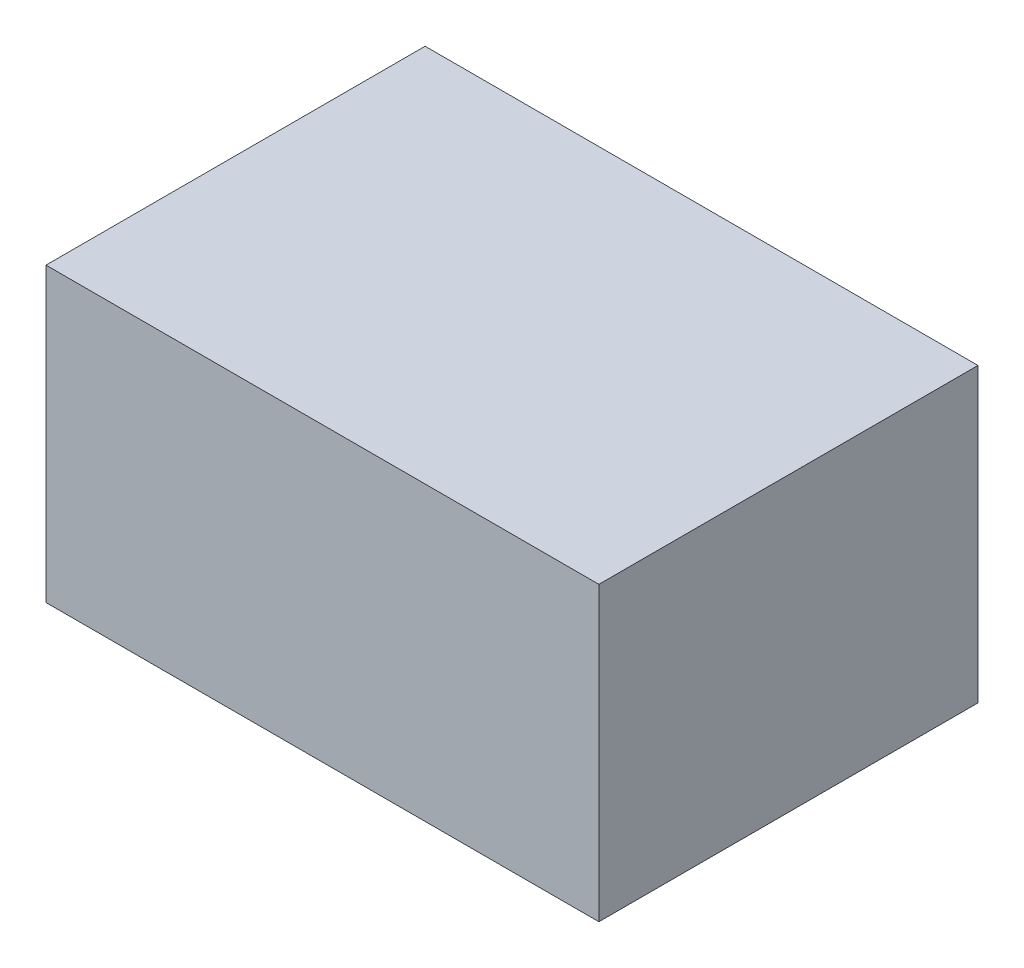
ISO-10303-21;
HEADER;
FILE_DESCRIPTION(('STEP AP214'),'2;1');
FILE_NAME('part.step','',(''),(''),'','','');
FILE_SCHEMA(('AUTOMOTIVE_DESIGN { 1 0 10303 214 1 1 1 1 }'));
ENDSEC;
DATA;
#1=APPLICATION_CONTEXT('core data for automotive mechanical design processes');
#2=APPLICATION_PROTOCOL_DEFINITION('international standard','automotive_design',2000,#1);
#3=PRODUCT_CONTEXT('',#1,'mechanical');
#4=PRODUCT('Part','Part','',(#3));
#5=PRODUCT_RELATED_PRODUCT_CATEGORY('part','',(#4));
#6=PRODUCT_DEFINITION_FORMATION('','',#4);
#7=PRODUCT_DEFINITION_CONTEXT('part definition',#1,'design');
#8=PRODUCT_DEFINITION('design','',#6,#7);
#9=PRODUCT_DEFINITION_SHAPE('','',#8);
#10=(LENGTH_UNIT() NAMED_UNIT(*) SI_UNIT(.MILLI.,.METRE.));
#11=(NAMED_UNIT(*) PLANE_ANGLE_UNIT() SI_UNIT($,.RADIAN.));
#12=(NAMED_UNIT(*) SI_UNIT($,.STERADIAN.) SOLID_ANGLE_UNIT());
#13=UNCERTAINTY_MEASURE_WITH_UNIT(LENGTH_MEASURE(1.E-05),#10,'distance_accuracy_value','');
#14=(GEOMETRIC_REPRESENTATION_CONTEXT(3) GLOBAL_UNCERTAINTY_ASSIGNED_CONTEXT((#13)) GLOBAL_UNIT_ASSIGNED_CONTEXT((#10,
#11,#12)) REPRESENTATION_CONTEXT('',''));
#15=CARTESIAN_POINT('',(0.,0.,0.));
#16=DIRECTION('',(0.,0.,1.));
#17=DIRECTION('',(1.,0.,0.));
#18=AXIS2_PLACEMENT_3D('',#15,#16,#17);
#19=CARTESIAN_POINT('',(11.7151941655056,23.0461624549828,24.));
#20=DIRECTION('',(0.,-1.,0.));
#21=DIRECTION('',(0.,0.,-1.));
#22=AXIS2_PLACEMENT_3D('',#19,#20,#21);
#23=PLANE('',#22);
#24=DIRECTION('',(-1.,0.,0.));
#25=VECTOR('',#24,1.);
#26=CARTESIAN_POINT('',(11.7151941655056,23.0461624549828,0.));
#27=LINE('',#26,#25);
#28=CARTESIAN_POINT('',(46.7151941655056,23.0461624549828,0.));
#29=VERTEX_POINT('',#28);
#30=CARTESIAN_POINT('',(11.7151941655056,23.0461624549828,0.));
#31=VERTEX_POINT('',#30);
#32=EDGE_CURVE('E98',#29,#31,#27,.T.);
#33=ORIENTED_EDGE('',*,*,#32,.T.);
#34=DIRECTION('',(0.,0.,-1.));
#35=VECTOR('',#34,1.);
#36=CARTESIAN_POINT('',(11.7151941655056,23.0461624549828,24.));
#37=LINE('',#36,#35);
#38=CARTESIAN_POINT('',(11.7151941655056,23.0461624549828,24.));
#39=VERTEX_POINT('',#38);
#40=EDGE_CURVE('E11',#39,#31,#37,.T.);
#41=ORIENTED_EDGE('',*,*,#40,.F.);
#42=DIRECTION('',(-1.,0.,0.));
#43=VECTOR('',#42,1.);
#44=CARTESIAN_POINT('',(11.7151941655056,23.0461624549828,24.));
#45=LINE('',#44,#43);
#46=CARTESIAN_POINT('',(46.7151941655056,23.0461624549828,24.));
#47=VERTEX_POINT('',#46);
#48=EDGE_CURVE('E86',#47,#39,#45,.T.);
#49=ORIENTED_EDGE('',*,*,#48,.F.);
#50=DIRECTION('',(0.,0.,-1.));
#51=VECTOR('',#50,1.);
#52=CARTESIAN_POINT('',(46.7151941655056,23.0461624549828,24.));
#53=LINE('',#52,#51);
#54=EDGE_CURVE('E94',#47,#29,#53,.T.);
#55=ORIENTED_EDGE('',*,*,#54,.T.);
#56=EDGE_LOOP('',(#33,#41,#49,#55));
#57=FACE_BOUND('',#56,.T.);
#58=ADVANCED_FACE('F35',(#57),#23,.F.);
#59=CARTESIAN_POINT('',(11.7151941655056,4.54616245498275,24.));
#60=DIRECTION('',(1.,0.,0.));
#61=DIRECTION('',(0.,0.,-1.));
#62=AXIS2_PLACEMENT_3D('',#59,#60,#61);
#63=PLANE('',#62);
#64=DIRECTION('',(0.,-1.,0.));
#65=VECTOR('',#64,1.);
#66=CARTESIAN_POINT('',(11.7151941655056,4.54616245498275,0.));
#67=LINE('',#66,#65);
#68=CARTESIAN_POINT('',(11.7151941655056,4.54616245498275,0.));
#69=VERTEX_POINT('',#68);
#70=EDGE_CURVE('E90',#31,#69,#67,.T.);
#71=ORIENTED_EDGE('',*,*,#70,.T.);
#72=DIRECTION('',(0.,0.,-1.));
#73=VECTOR('',#72,1.);
#74=CARTESIAN_POINT('',(11.7151941655056,4.54616245498275,24.));
#75=LINE('',#74,#73);
#76=CARTESIAN_POINT('',(11.7151941655056,4.54616245498275,24.));
#77=VERTEX_POINT('',#76);
#78=EDGE_CURVE('E43',#77,#69,#75,.T.);
#79=ORIENTED_EDGE('',*,*,#78,.F.);
#80=DIRECTION('',(0.,-1.,0.));
#81=VECTOR('',#80,1.);
#82=CARTESIAN_POINT('',(11.7151941655056,4.54616245498275,24.));
#83=LINE('',#82,#81);
#84=EDGE_CURVE('E81',#39,#77,#83,.T.);
#85=ORIENTED_EDGE('',*,*,#84,.F.);
#86=ORIENTED_EDGE('',*,*,#40,.T.);
#87=EDGE_LOOP('',(#71,#79,#85,#86));
#88=FACE_BOUND('',#87,.T.);
#89=ADVANCED_FACE('F89',(#88),#63,.F.);
#90=CARTESIAN_POINT('',(46.7151941655056,4.54616245498276,24.));
#91=DIRECTION('',(0.,1.,0.));
#92=DIRECTION('',(-1.,0.,0.));
#93=AXIS2_PLACEMENT_3D('',#90,#91,#92);
#94=PLANE('',#93);
#95=DIRECTION('',(1.,0.,0.));
#96=VECTOR('',#95,1.);
#97=CARTESIAN_POINT('',(46.7151941655056,4.54616245498276,0.));
#98=LINE('',#97,#96);
#99=CARTESIAN_POINT('',(46.7151941655056,4.54616245498276,0.));
#100=VERTEX_POINT('',#99);
#101=EDGE_CURVE('E68',#69,#100,#98,.T.);
#102=ORIENTED_EDGE('',*,*,#101,.T.);
#103=DIRECTION('',(0.,0.,-1.));
#104=VECTOR('',#103,1.);
#105=CARTESIAN_POINT('',(46.7151941655056,4.54616245498276,24.));
#106=LINE('',#105,#104);
#107=CARTESIAN_POINT('',(46.7151941655056,4.54616245498276,24.));
#108=VERTEX_POINT('',#107);
#109=EDGE_CURVE('E91',#108,#100,#106,.T.);
#110=ORIENTED_EDGE('',*,*,#109,.F.);
#111=DIRECTION('',(1.,0.,0.));
#112=VECTOR('',#111,1.);
#113=CARTESIAN_POINT('',(46.7151941655056,4.54616245498276,24.));
#114=LINE('',#113,#112);
#115=EDGE_CURVE('E84',#77,#108,#114,.T.);
#116=ORIENTED_EDGE('',*,*,#115,.F.);
#117=ORIENTED_EDGE('',*,*,#78,.T.);
#118=EDGE_LOOP('',(#102,#110,#116,#117));
#119=FACE_BOUND('',#118,.T.);
#120=ADVANCED_FACE('F92',(#119),#94,.F.);
#121=CARTESIAN_POINT('',(46.7151941655056,23.0461624549828,24.));
#122=DIRECTION('',(-1.,0.,0.));
#123=DIRECTION('',(0.,0.,1.));
#124=AXIS2_PLACEMENT_3D('',#121,#122,#123);
#125=PLANE('',#124);
#126=DIRECTION('',(0.,1.,0.));
#127=VECTOR('',#126,1.);
#128=CARTESIAN_POINT('',(46.7151941655056,23.0461624549828,0.));
#129=LINE('',#128,#127);
#130=EDGE_CURVE('E74',#100,#29,#129,.T.);
#131=ORIENTED_EDGE('',*,*,#130,.T.);
#132=ORIENTED_EDGE('',*,*,#54,.F.);
#133=DIRECTION('',(0.,1.,0.));
#134=VECTOR('',#133,1.);
#135=CARTESIAN_POINT('',(46.7151941655056,23.0461624549828,24.));
#136=LINE('',#135,#134);
#137=EDGE_CURVE('E51',#108,#47,#136,.T.);
#138=ORIENTED_EDGE('',*,*,#137,.F.);
#139=ORIENTED_EDGE('',*,*,#109,.T.);
#140=EDGE_LOOP('',(#131,#132,#138,#139));
#141=FACE_BOUND('',#140,.T.);
#142=ADVANCED_FACE('F105',(#141),#125,.F.);
#143=CARTESIAN_POINT('',(0.,0.,24.));
#144=DIRECTION('',(0.,0.,-1.));
#145=DIRECTION('',(-1.,0.,0.));
#146=AXIS2_PLACEMENT_3D('',#143,#144,#145);
#147=PLANE('',#146);
#148=ORIENTED_EDGE('',*,*,#48,.T.);
#149=ORIENTED_EDGE('',*,*,#84,.T.);
#150=ORIENTED_EDGE('',*,*,#115,.T.);
#151=ORIENTED_EDGE('',*,*,#137,.T.);
#152=EDGE_LOOP('',(#148,#149,#150,#151));
#153=FACE_BOUND('',#152,.T.);
#154=ADVANCED_FACE('F82',(#153),#147,.F.);
#155=CARTESIAN_POINT('',(0.,0.,0.));
#156=DIRECTION('',(0.,0.,-1.));
#157=DIRECTION('',(-1.,0.,0.));
#158=AXIS2_PLACEMENT_3D('',#155,#156,#157);
#159=PLANE('',#158);
#160=ORIENTED_EDGE('',*,*,#32,.F.);
#161=ORIENTED_EDGE('',*,*,#130,.F.);
#162=ORIENTED_EDGE('',*,*,#101,.F.);
#163=ORIENTED_EDGE('',*,*,#70,.F.);
#164=EDGE_LOOP('',(#160,#161,#162,#163));
#165=FACE_BOUND('',#164,.T.);
#166=ADVANCED_FACE('F108',(#165),#159,.T.);
#167=CLOSED_SHELL('',(#58,#89,#120,#142,#154,#166));
#168=MANIFOLD_SOLID_BREP('B2',#167);
#169=ADVANCED_BREP_SHAPE_REPRESENTATION('',(#18,#168),#14);
#170=SHAPE_DEFINITION_REPRESENTATION(#9,#169);
ENDSEC;
END-ISO-10303-21;
